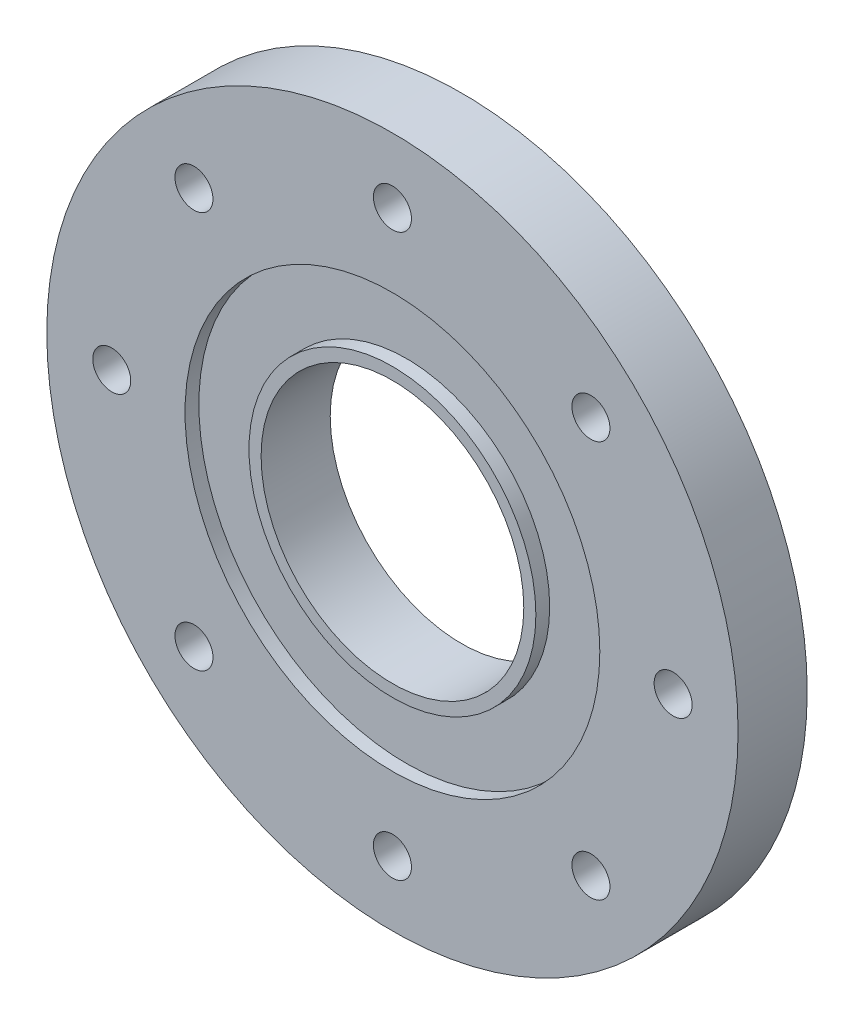
ISO-10303-21;
HEADER;
FILE_DESCRIPTION(('STEP AP214'),'2;1');
FILE_NAME('part.step','',(''),(''),'','','');
FILE_SCHEMA(('AUTOMOTIVE_DESIGN { 1 0 10303 214 1 1 1 1 }'));
ENDSEC;
DATA;
#1=APPLICATION_CONTEXT('core data for automotive mechanical design processes');
#2=APPLICATION_PROTOCOL_DEFINITION('international standard','automotive_design',2000,#1);
#3=PRODUCT_CONTEXT('',#1,'mechanical');
#4=PRODUCT('Part','Part','',(#3));
#5=PRODUCT_RELATED_PRODUCT_CATEGORY('part','',(#4));
#6=PRODUCT_DEFINITION_FORMATION('','',#4);
#7=PRODUCT_DEFINITION_CONTEXT('part definition',#1,'design');
#8=PRODUCT_DEFINITION('design','',#6,#7);
#9=PRODUCT_DEFINITION_SHAPE('','',#8);
#10=(LENGTH_UNIT() NAMED_UNIT(*) SI_UNIT(.MILLI.,.METRE.));
#11=(NAMED_UNIT(*) PLANE_ANGLE_UNIT() SI_UNIT($,.RADIAN.));
#12=(NAMED_UNIT(*) SI_UNIT($,.STERADIAN.) SOLID_ANGLE_UNIT());
#13=UNCERTAINTY_MEASURE_WITH_UNIT(LENGTH_MEASURE(1.E-05),#10,'distance_accuracy_value','');
#14=(GEOMETRIC_REPRESENTATION_CONTEXT(3) GLOBAL_UNCERTAINTY_ASSIGNED_CONTEXT((#13)) GLOBAL_UNIT_ASSIGNED_CONTEXT((#10,
#11,#12)) REPRESENTATION_CONTEXT('',''));
#15=CARTESIAN_POINT('',(0.,0.,0.));
#16=DIRECTION('',(0.,0.,1.));
#17=DIRECTION('',(1.,0.,0.));
#18=AXIS2_PLACEMENT_3D('',#15,#16,#17);
#19=CARTESIAN_POINT('',(0.,0.,10.));
#20=DIRECTION('',(0.,0.,1.));
#21=DIRECTION('',(1.,0.,0.));
#22=AXIS2_PLACEMENT_3D('',#19,#20,#21);
#23=PLANE('',#22);
#24=CARTESIAN_POINT('',(0.,0.,10.));
#25=DIRECTION('',(0.,0.,1.));
#26=DIRECTION('',(1.,0.,0.));
#27=AXIS2_PLACEMENT_3D('',#24,#25,#26);
#28=CIRCLE('',#27,19.);
#29=CARTESIAN_POINT('',(19.,0.,10.));
#30=VERTEX_POINT('',#29);
#31=EDGE_CURVE('E42',#30,#30,#28,.T.);
#32=ORIENTED_EDGE('',*,*,#31,.F.);
#33=EDGE_LOOP('',(#32));
#34=FACE_BOUND('',#33,.T.);
#35=CARTESIAN_POINT('',(0.,0.,10.));
#36=DIRECTION('',(0.,0.,1.));
#37=DIRECTION('',(1.,0.,0.));
#38=AXIS2_PLACEMENT_3D('',#35,#36,#37);
#39=CIRCLE('',#38,20.75);
#40=CARTESIAN_POINT('',(20.75,0.,10.));
#41=VERTEX_POINT('',#40);
#42=EDGE_CURVE('E56',#41,#41,#39,.T.);
#43=ORIENTED_EDGE('',*,*,#42,.T.);
#44=EDGE_LOOP('',(#43));
#45=FACE_BOUND('',#44,.T.);
#46=ADVANCED_FACE('F31',(#34,#45),#23,.T.);
#47=CARTESIAN_POINT('',(28.7106551721743,-28.7106551721744,10.));
#48=DIRECTION('',(0.,0.,1.));
#49=DIRECTION('',(1.,0.,0.));
#50=AXIS2_PLACEMENT_3D('',#47,#48,#49);
#51=CIRCLE('',#50,2.75);
#52=CARTESIAN_POINT('',(31.4606551721743,-28.7106551721744,10.));
#53=VERTEX_POINT('',#52);
#54=EDGE_CURVE('E103',#53,#53,#51,.T.);
#55=ORIENTED_EDGE('',*,*,#54,.F.);
#56=EDGE_LOOP('',(#55));
#57=FACE_BOUND('',#56,.T.);
#58=CARTESIAN_POINT('',(-1.41764609570561E-13,-40.6029979291063,10.));
#59=DIRECTION('',(0.,0.,1.));
#60=DIRECTION('',(1.,0.,0.));
#61=AXIS2_PLACEMENT_3D('',#58,#59,#60);
#62=CIRCLE('',#61,2.75);
#63=CARTESIAN_POINT('',(2.74999999999986,-40.6029979291063,10.));
#64=VERTEX_POINT('',#63);
#65=EDGE_CURVE('E97',#64,#64,#62,.T.);
#66=ORIENTED_EDGE('',*,*,#65,.F.);
#67=EDGE_LOOP('',(#66));
#68=FACE_BOUND('',#67,.T.);
#69=CARTESIAN_POINT('',(-28.7106551721745,-28.7106551721742,10.));
#70=DIRECTION('',(0.,0.,1.));
#71=DIRECTION('',(1.,0.,0.));
#72=AXIS2_PLACEMENT_3D('',#69,#70,#71);
#73=CIRCLE('',#72,2.75);
#74=CARTESIAN_POINT('',(-25.9606551721745,-28.7106551721742,10.));
#75=VERTEX_POINT('',#74);
#76=EDGE_CURVE('E91',#75,#75,#73,.T.);
#77=ORIENTED_EDGE('',*,*,#76,.F.);
#78=EDGE_LOOP('',(#77));
#79=FACE_BOUND('',#78,.T.);
#80=CARTESIAN_POINT('',(-40.6029979291063,2.83529219141122E-13,10.));
#81=DIRECTION('',(0.,0.,1.));
#82=DIRECTION('',(1.,0.,0.));
#83=AXIS2_PLACEMENT_3D('',#80,#81,#82);
#84=CIRCLE('',#83,2.75);
#85=CARTESIAN_POINT('',(-37.8529979291063,2.83529219141122E-13,10.));
#86=VERTEX_POINT('',#85);
#87=EDGE_CURVE('E85',#86,#86,#84,.T.);
#88=ORIENTED_EDGE('',*,*,#87,.F.);
#89=EDGE_LOOP('',(#88));
#90=FACE_BOUND('',#89,.T.);
#91=CARTESIAN_POINT('',(-28.7106551721741,28.7106551721746,10.));
#92=DIRECTION('',(0.,0.,1.));
#93=DIRECTION('',(1.,0.,0.));
#94=AXIS2_PLACEMENT_3D('',#91,#92,#93);
#95=CIRCLE('',#94,2.75);
#96=CARTESIAN_POINT('',(-25.9606551721741,28.7106551721746,10.));
#97=VERTEX_POINT('',#96);
#98=EDGE_CURVE('E79',#97,#97,#95,.T.);
#99=ORIENTED_EDGE('',*,*,#98,.F.);
#100=EDGE_LOOP('',(#99));
#101=FACE_BOUND('',#100,.T.);
#102=CARTESIAN_POINT('',(4.25293828711683E-13,40.6029979291063,10.));
#103=DIRECTION('',(0.,0.,1.));
#104=DIRECTION('',(1.,0.,0.));
#105=AXIS2_PLACEMENT_3D('',#102,#103,#104);
#106=CIRCLE('',#105,2.75);
#107=CARTESIAN_POINT('',(2.75000000000043,40.6029979291063,10.));
#108=VERTEX_POINT('',#107);
#109=EDGE_CURVE('E73',#108,#108,#106,.T.);
#110=ORIENTED_EDGE('',*,*,#109,.F.);
#111=EDGE_LOOP('',(#110));
#112=FACE_BOUND('',#111,.T.);
#113=CARTESIAN_POINT('',(28.7106551721747,28.710655172174,10.));
#114=DIRECTION('',(0.,0.,1.));
#115=DIRECTION('',(1.,0.,0.));
#116=AXIS2_PLACEMENT_3D('',#113,#114,#115);
#117=CIRCLE('',#116,2.75);
#118=CARTESIAN_POINT('',(31.4606551721747,28.710655172174,10.));
#119=VERTEX_POINT('',#118);
#120=EDGE_CURVE('E67',#119,#119,#117,.T.);
#121=ORIENTED_EDGE('',*,*,#120,.F.);
#122=EDGE_LOOP('',(#121));
#123=FACE_BOUND('',#122,.T.);
#124=CARTESIAN_POINT('',(40.6029979291063,0.,10.));
#125=DIRECTION('',(0.,0.,1.));
#126=DIRECTION('',(1.,0.,0.));
#127=AXIS2_PLACEMENT_3D('',#124,#125,#126);
#128=CIRCLE('',#127,2.75);
#129=CARTESIAN_POINT('',(43.3529979291063,0.,10.));
#130=VERTEX_POINT('',#129);
#131=EDGE_CURVE('E64',#130,#130,#128,.T.);
#132=ORIENTED_EDGE('',*,*,#131,.F.);
#133=EDGE_LOOP('',(#132));
#134=FACE_BOUND('',#133,.T.);
#135=CARTESIAN_POINT('',(0.,0.,10.));
#136=DIRECTION('',(0.,0.,1.));
#137=DIRECTION('',(1.,0.,0.));
#138=AXIS2_PLACEMENT_3D('',#135,#136,#137);
#139=CIRCLE('',#138,30.);
#140=CARTESIAN_POINT('',(30.,0.,10.));
#141=VERTEX_POINT('',#140);
#142=EDGE_CURVE('E50',#141,#141,#139,.T.);
#143=ORIENTED_EDGE('',*,*,#142,.F.);
#144=EDGE_LOOP('',(#143));
#145=FACE_BOUND('',#144,.T.);
#146=CARTESIAN_POINT('',(0.,0.,10.));
#147=DIRECTION('',(0.,0.,1.));
#148=DIRECTION('',(1.,0.,0.));
#149=AXIS2_PLACEMENT_3D('',#146,#147,#148);
#150=CIRCLE('',#149,50.);
#151=CARTESIAN_POINT('',(50.,0.,10.));
#152=VERTEX_POINT('',#151);
#153=EDGE_CURVE('E10',#152,#152,#150,.T.);
#154=ORIENTED_EDGE('',*,*,#153,.T.);
#155=EDGE_LOOP('',(#154));
#156=FACE_BOUND('',#155,.T.);
#157=ADVANCED_FACE('F116',(#57,#68,#79,#90,#101,#112,#123,#134,#145,#156),#23,.T.);
#158=CARTESIAN_POINT('',(0.,0.,0.));
#159=DIRECTION('',(0.,0.,1.));
#160=DIRECTION('',(1.,0.,0.));
#161=AXIS2_PLACEMENT_3D('',#158,#159,#160);
#162=PLANE('',#161);
#163=CARTESIAN_POINT('',(28.7106551721743,-28.7106551721744,0.));
#164=DIRECTION('',(0.,0.,1.));
#165=DIRECTION('',(1.,0.,0.));
#166=AXIS2_PLACEMENT_3D('',#163,#164,#165);
#167=CIRCLE('',#166,2.75);
#168=CARTESIAN_POINT('',(31.4606551721743,-28.7106551721744,0.));
#169=VERTEX_POINT('',#168);
#170=EDGE_CURVE('E106',#169,#169,#167,.F.);
#171=ORIENTED_EDGE('',*,*,#170,.F.);
#172=EDGE_LOOP('',(#171));
#173=FACE_BOUND('',#172,.T.);
#174=CARTESIAN_POINT('',(-1.41764609570561E-13,-40.6029979291063,0.));
#175=DIRECTION('',(0.,0.,1.));
#176=DIRECTION('',(1.,0.,0.));
#177=AXIS2_PLACEMENT_3D('',#174,#175,#176);
#178=CIRCLE('',#177,2.75);
#179=CARTESIAN_POINT('',(2.74999999999986,-40.6029979291063,0.));
#180=VERTEX_POINT('',#179);
#181=EDGE_CURVE('E100',#180,#180,#178,.F.);
#182=ORIENTED_EDGE('',*,*,#181,.F.);
#183=EDGE_LOOP('',(#182));
#184=FACE_BOUND('',#183,.T.);
#185=CARTESIAN_POINT('',(-28.7106551721745,-28.7106551721742,0.));
#186=DIRECTION('',(0.,0.,1.));
#187=DIRECTION('',(1.,0.,0.));
#188=AXIS2_PLACEMENT_3D('',#185,#186,#187);
#189=CIRCLE('',#188,2.75);
#190=CARTESIAN_POINT('',(-25.9606551721745,-28.7106551721742,0.));
#191=VERTEX_POINT('',#190);
#192=EDGE_CURVE('E94',#191,#191,#189,.F.);
#193=ORIENTED_EDGE('',*,*,#192,.F.);
#194=EDGE_LOOP('',(#193));
#195=FACE_BOUND('',#194,.T.);
#196=CARTESIAN_POINT('',(-40.6029979291063,2.83529219141122E-13,0.));
#197=DIRECTION('',(0.,0.,1.));
#198=DIRECTION('',(1.,0.,0.));
#199=AXIS2_PLACEMENT_3D('',#196,#197,#198);
#200=CIRCLE('',#199,2.75);
#201=CARTESIAN_POINT('',(-37.8529979291063,2.83529219141122E-13,0.));
#202=VERTEX_POINT('',#201);
#203=EDGE_CURVE('E88',#202,#202,#200,.F.);
#204=ORIENTED_EDGE('',*,*,#203,.F.);
#205=EDGE_LOOP('',(#204));
#206=FACE_BOUND('',#205,.T.);
#207=CARTESIAN_POINT('',(-28.7106551721741,28.7106551721746,0.));
#208=DIRECTION('',(0.,0.,1.));
#209=DIRECTION('',(1.,0.,0.));
#210=AXIS2_PLACEMENT_3D('',#207,#208,#209);
#211=CIRCLE('',#210,2.75);
#212=CARTESIAN_POINT('',(-25.9606551721741,28.7106551721746,0.));
#213=VERTEX_POINT('',#212);
#214=EDGE_CURVE('E82',#213,#213,#211,.F.);
#215=ORIENTED_EDGE('',*,*,#214,.F.);
#216=EDGE_LOOP('',(#215));
#217=FACE_BOUND('',#216,.T.);
#218=CARTESIAN_POINT('',(4.25293828711683E-13,40.6029979291063,0.));
#219=DIRECTION('',(0.,0.,1.));
#220=DIRECTION('',(1.,0.,0.));
#221=AXIS2_PLACEMENT_3D('',#218,#219,#220);
#222=CIRCLE('',#221,2.75);
#223=CARTESIAN_POINT('',(2.75000000000043,40.6029979291063,0.));
#224=VERTEX_POINT('',#223);
#225=EDGE_CURVE('E76',#224,#224,#222,.F.);
#226=ORIENTED_EDGE('',*,*,#225,.F.);
#227=EDGE_LOOP('',(#226));
#228=FACE_BOUND('',#227,.T.);
#229=CARTESIAN_POINT('',(28.7106551721747,28.710655172174,0.));
#230=DIRECTION('',(0.,0.,1.));
#231=DIRECTION('',(1.,0.,0.));
#232=AXIS2_PLACEMENT_3D('',#229,#230,#231);
#233=CIRCLE('',#232,2.75);
#234=CARTESIAN_POINT('',(31.4606551721747,28.710655172174,0.));
#235=VERTEX_POINT('',#234);
#236=EDGE_CURVE('E70',#235,#235,#233,.F.);
#237=ORIENTED_EDGE('',*,*,#236,.F.);
#238=EDGE_LOOP('',(#237));
#239=FACE_BOUND('',#238,.T.);
#240=CARTESIAN_POINT('',(40.6029979291063,0.,0.));
#241=DIRECTION('',(0.,0.,1.));
#242=DIRECTION('',(1.,0.,0.));
#243=AXIS2_PLACEMENT_3D('',#240,#241,#242);
#244=CIRCLE('',#243,2.75);
#245=CARTESIAN_POINT('',(43.3529979291063,0.,0.));
#246=VERTEX_POINT('',#245);
#247=EDGE_CURVE('E59',#246,#246,#244,.F.);
#248=ORIENTED_EDGE('',*,*,#247,.F.);
#249=EDGE_LOOP('',(#248));
#250=FACE_BOUND('',#249,.T.);
#251=CARTESIAN_POINT('',(0.,0.,0.));
#252=DIRECTION('',(0.,0.,1.));
#253=DIRECTION('',(1.,0.,0.));
#254=AXIS2_PLACEMENT_3D('',#251,#252,#253);
#255=CIRCLE('',#254,50.);
#256=CARTESIAN_POINT('',(50.,0.,0.));
#257=VERTEX_POINT('',#256);
#258=EDGE_CURVE('E35',#257,#257,#255,.T.);
#259=ORIENTED_EDGE('',*,*,#258,.F.);
#260=EDGE_LOOP('',(#259));
#261=FACE_BOUND('',#260,.T.);
#262=CARTESIAN_POINT('',(0.,0.,0.));
#263=DIRECTION('',(0.,0.,1.));
#264=DIRECTION('',(1.,0.,0.));
#265=AXIS2_PLACEMENT_3D('',#262,#263,#264);
#266=CIRCLE('',#265,19.);
#267=CARTESIAN_POINT('',(19.,0.,0.));
#268=VERTEX_POINT('',#267);
#269=EDGE_CURVE('E44',#268,#268,#266,.T.);
#270=ORIENTED_EDGE('',*,*,#269,.T.);
#271=EDGE_LOOP('',(#270));
#272=FACE_BOUND('',#271,.T.);
#273=ADVANCED_FACE('F113',(#173,#184,#195,#206,#217,#228,#239,#250,#261,#272),#162,.F.);
#274=CARTESIAN_POINT('',(0.,0.,10.));
#275=DIRECTION('',(0.,0.,-1.));
#276=DIRECTION('',(-1.,0.,0.));
#277=AXIS2_PLACEMENT_3D('',#274,#275,#276);
#278=CYLINDRICAL_SURFACE('',#277,50.);
#279=ORIENTED_EDGE('',*,*,#153,.F.);
#280=EDGE_LOOP('',(#279));
#281=FACE_BOUND('',#280,.T.);
#282=ORIENTED_EDGE('',*,*,#258,.T.);
#283=EDGE_LOOP('',(#282));
#284=FACE_BOUND('',#283,.T.);
#285=ADVANCED_FACE('F33',(#281,#284),#278,.T.);
#286=CARTESIAN_POINT('',(0.,0.,10.));
#287=DIRECTION('',(0.,0.,-1.));
#288=DIRECTION('',(-1.,0.,0.));
#289=AXIS2_PLACEMENT_3D('',#286,#287,#288);
#290=CYLINDRICAL_SURFACE('',#289,19.);
#291=ORIENTED_EDGE('',*,*,#31,.T.);
#292=EDGE_LOOP('',(#291));
#293=FACE_BOUND('',#292,.T.);
#294=ORIENTED_EDGE('',*,*,#269,.F.);
#295=EDGE_LOOP('',(#294));
#296=FACE_BOUND('',#295,.T.);
#297=ADVANCED_FACE('F135',(#293,#296),#290,.F.);
#298=CARTESIAN_POINT('',(0.,0.,8.));
#299=DIRECTION('',(0.,0.,1.));
#300=DIRECTION('',(1.,0.,0.));
#301=AXIS2_PLACEMENT_3D('',#298,#299,#300);
#302=CYLINDRICAL_SURFACE('',#301,30.);
#303=CARTESIAN_POINT('',(0.,0.,8.));
#304=DIRECTION('',(0.,0.,1.));
#305=DIRECTION('',(1.,0.,0.));
#306=AXIS2_PLACEMENT_3D('',#303,#304,#305);
#307=CIRCLE('',#306,30.);
#308=CARTESIAN_POINT('',(30.,0.,8.));
#309=VERTEX_POINT('',#308);
#310=EDGE_CURVE('E47',#309,#309,#307,.T.);
#311=ORIENTED_EDGE('',*,*,#310,.F.);
#312=EDGE_LOOP('',(#311));
#313=FACE_BOUND('',#312,.T.);
#314=ORIENTED_EDGE('',*,*,#142,.T.);
#315=EDGE_LOOP('',(#314));
#316=FACE_BOUND('',#315,.T.);
#317=ADVANCED_FACE('F137',(#313,#316),#302,.F.);
#318=CARTESIAN_POINT('',(0.,0.,8.));
#319=DIRECTION('',(0.,0.,1.));
#320=DIRECTION('',(1.,0.,0.));
#321=AXIS2_PLACEMENT_3D('',#318,#319,#320);
#322=PLANE('',#321);
#323=CARTESIAN_POINT('',(0.,0.,8.));
#324=DIRECTION('',(0.,0.,1.));
#325=DIRECTION('',(1.,0.,0.));
#326=AXIS2_PLACEMENT_3D('',#323,#324,#325);
#327=CIRCLE('',#326,20.75);
#328=CARTESIAN_POINT('',(20.75,0.,8.));
#329=VERTEX_POINT('',#328);
#330=EDGE_CURVE('E53',#329,#329,#327,.T.);
#331=ORIENTED_EDGE('',*,*,#330,.F.);
#332=EDGE_LOOP('',(#331));
#333=FACE_BOUND('',#332,.T.);
#334=ORIENTED_EDGE('',*,*,#310,.T.);
#335=EDGE_LOOP('',(#334));
#336=FACE_BOUND('',#335,.T.);
#337=ADVANCED_FACE('F144',(#333,#336),#322,.T.);
#338=CARTESIAN_POINT('',(0.,0.,8.));
#339=DIRECTION('',(0.,0.,1.));
#340=DIRECTION('',(1.,0.,0.));
#341=AXIS2_PLACEMENT_3D('',#338,#339,#340);
#342=CYLINDRICAL_SURFACE('',#341,20.75);
#343=ORIENTED_EDGE('',*,*,#330,.T.);
#344=EDGE_LOOP('',(#343));
#345=FACE_BOUND('',#344,.T.);
#346=ORIENTED_EDGE('',*,*,#42,.F.);
#347=EDGE_LOOP('',(#346));
#348=FACE_BOUND('',#347,.T.);
#349=ADVANCED_FACE('F159',(#345,#348),#342,.T.);
#350=CARTESIAN_POINT('',(40.6029979291063,0.,-7.77817459305203));
#351=DIRECTION('',(0.,0.,1.));
#352=DIRECTION('',(1.,0.,0.));
#353=AXIS2_PLACEMENT_3D('',#350,#351,#352);
#354=CYLINDRICAL_SURFACE('',#353,2.75);
#355=ORIENTED_EDGE('',*,*,#247,.T.);
#356=EDGE_LOOP('',(#355));
#357=FACE_BOUND('',#356,.T.);
#358=ORIENTED_EDGE('',*,*,#131,.T.);
#359=EDGE_LOOP('',(#358));
#360=FACE_BOUND('',#359,.T.);
#361=ADVANCED_FACE('F161',(#357,#360),#354,.F.);
#362=CARTESIAN_POINT('',(28.7106551721747,28.710655172174,-7.77817459305203));
#363=DIRECTION('',(0.,0.,1.));
#364=DIRECTION('',(1.,0.,0.));
#365=AXIS2_PLACEMENT_3D('',#362,#363,#364);
#366=CYLINDRICAL_SURFACE('',#365,2.75);
#367=ORIENTED_EDGE('',*,*,#236,.T.);
#368=EDGE_LOOP('',(#367));
#369=FACE_BOUND('',#368,.T.);
#370=ORIENTED_EDGE('',*,*,#120,.T.);
#371=EDGE_LOOP('',(#370));
#372=FACE_BOUND('',#371,.T.);
#373=ADVANCED_FACE('F168',(#369,#372),#366,.F.);
#374=CARTESIAN_POINT('',(4.25293828711683E-13,40.6029979291063,-7.77817459305203));
#375=DIRECTION('',(0.,0.,1.));
#376=DIRECTION('',(1.,0.,0.));
#377=AXIS2_PLACEMENT_3D('',#374,#375,#376);
#378=CYLINDRICAL_SURFACE('',#377,2.75);
#379=ORIENTED_EDGE('',*,*,#225,.T.);
#380=EDGE_LOOP('',(#379));
#381=FACE_BOUND('',#380,.T.);
#382=ORIENTED_EDGE('',*,*,#109,.T.);
#383=EDGE_LOOP('',(#382));
#384=FACE_BOUND('',#383,.T.);
#385=ADVANCED_FACE('F176',(#381,#384),#378,.F.);
#386=CARTESIAN_POINT('',(-28.7106551721741,28.7106551721746,-7.77817459305203));
#387=DIRECTION('',(0.,0.,1.));
#388=DIRECTION('',(1.,0.,0.));
#389=AXIS2_PLACEMENT_3D('',#386,#387,#388);
#390=CYLINDRICAL_SURFACE('',#389,2.75);
#391=ORIENTED_EDGE('',*,*,#214,.T.);
#392=EDGE_LOOP('',(#391));
#393=FACE_BOUND('',#392,.T.);
#394=ORIENTED_EDGE('',*,*,#98,.T.);
#395=EDGE_LOOP('',(#394));
#396=FACE_BOUND('',#395,.T.);
#397=ADVANCED_FACE('F180',(#393,#396),#390,.F.);
#398=CARTESIAN_POINT('',(-40.6029979291063,2.83529219141122E-13,-7.77817459305203));
#399=DIRECTION('',(0.,0.,1.));
#400=DIRECTION('',(1.,0.,0.));
#401=AXIS2_PLACEMENT_3D('',#398,#399,#400);
#402=CYLINDRICAL_SURFACE('',#401,2.75);
#403=ORIENTED_EDGE('',*,*,#203,.T.);
#404=EDGE_LOOP('',(#403));
#405=FACE_BOUND('',#404,.T.);
#406=ORIENTED_EDGE('',*,*,#87,.T.);
#407=EDGE_LOOP('',(#406));
#408=FACE_BOUND('',#407,.T.);
#409=ADVANCED_FACE('F184',(#405,#408),#402,.F.);
#410=CARTESIAN_POINT('',(-28.7106551721745,-28.7106551721742,-7.77817459305203));
#411=DIRECTION('',(0.,0.,1.));
#412=DIRECTION('',(1.,0.,0.));
#413=AXIS2_PLACEMENT_3D('',#410,#411,#412);
#414=CYLINDRICAL_SURFACE('',#413,2.75);
#415=ORIENTED_EDGE('',*,*,#192,.T.);
#416=EDGE_LOOP('',(#415));
#417=FACE_BOUND('',#416,.T.);
#418=ORIENTED_EDGE('',*,*,#76,.T.);
#419=EDGE_LOOP('',(#418));
#420=FACE_BOUND('',#419,.T.);
#421=ADVANCED_FACE('F188',(#417,#420),#414,.F.);
#422=CARTESIAN_POINT('',(-1.41764609570561E-13,-40.6029979291063,-7.77817459305203));
#423=DIRECTION('',(0.,0.,1.));
#424=DIRECTION('',(1.,0.,0.));
#425=AXIS2_PLACEMENT_3D('',#422,#423,#424);
#426=CYLINDRICAL_SURFACE('',#425,2.75);
#427=ORIENTED_EDGE('',*,*,#181,.T.);
#428=EDGE_LOOP('',(#427));
#429=FACE_BOUND('',#428,.T.);
#430=ORIENTED_EDGE('',*,*,#65,.T.);
#431=EDGE_LOOP('',(#430));
#432=FACE_BOUND('',#431,.T.);
#433=ADVANCED_FACE('F192',(#429,#432),#426,.F.);
#434=CARTESIAN_POINT('',(28.7106551721743,-28.7106551721744,-7.77817459305203));
#435=DIRECTION('',(0.,0.,1.));
#436=DIRECTION('',(1.,0.,0.));
#437=AXIS2_PLACEMENT_3D('',#434,#435,#436);
#438=CYLINDRICAL_SURFACE('',#437,2.75);
#439=ORIENTED_EDGE('',*,*,#170,.T.);
#440=EDGE_LOOP('',(#439));
#441=FACE_BOUND('',#440,.T.);
#442=ORIENTED_EDGE('',*,*,#54,.T.);
#443=EDGE_LOOP('',(#442));
#444=FACE_BOUND('',#443,.T.);
#445=ADVANCED_FACE('F110',(#441,#444),#438,.F.);
#446=CLOSED_SHELL('',(#46,#157,#273,#285,#297,#317,#337,#349,#361,#373,#385,#397,#409,#421,#433,#445));
#447=MANIFOLD_SOLID_BREP('B2',#446);
#448=ADVANCED_BREP_SHAPE_REPRESENTATION('',(#18,#447),#14);
#449=SHAPE_DEFINITION_REPRESENTATION(#9,#448);
ENDSEC;
END-ISO-10303-21;
